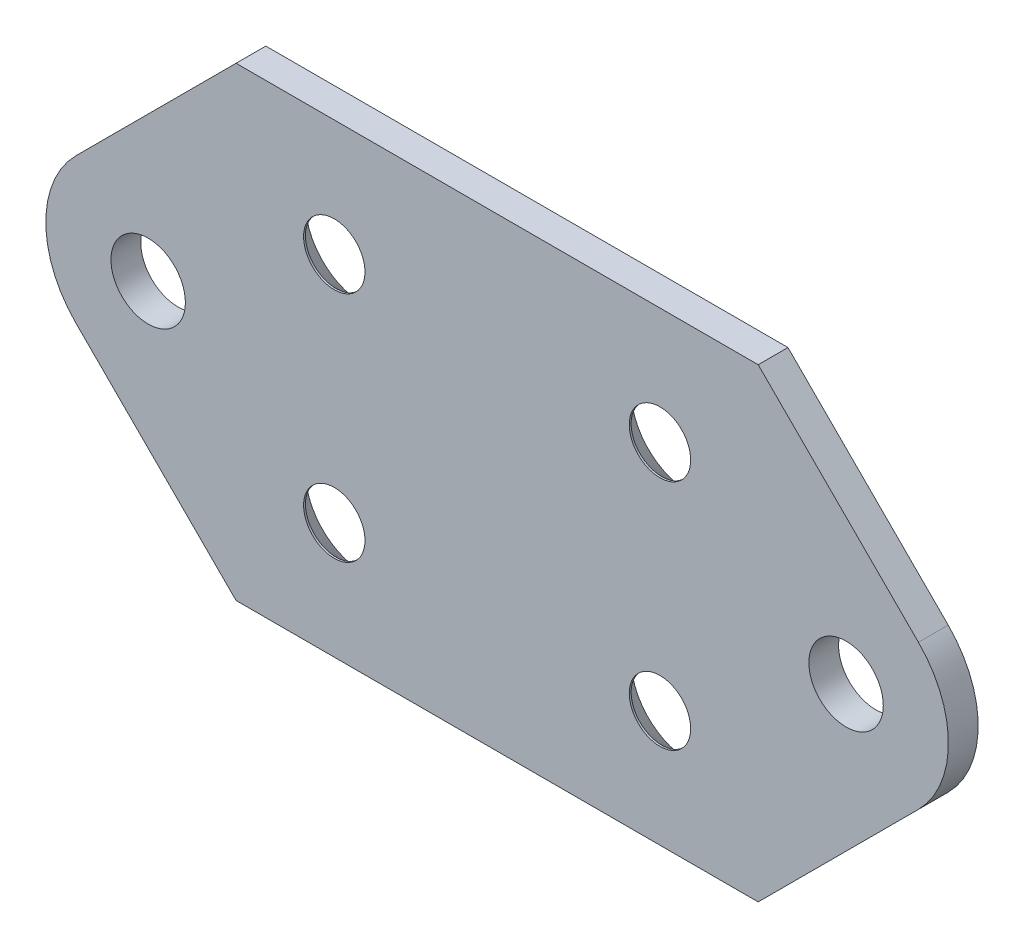
ISO-10303-21;
HEADER;
FILE_DESCRIPTION(('STEP AP214'),'2;1');
FILE_NAME('part.step','',(''),(''),'','','');
FILE_SCHEMA(('AUTOMOTIVE_DESIGN { 1 0 10303 214 1 1 1 1 }'));
ENDSEC;
DATA;
#1=APPLICATION_CONTEXT('core data for automotive mechanical design processes');
#2=APPLICATION_PROTOCOL_DEFINITION('international standard','automotive_design',2000,#1);
#3=PRODUCT_CONTEXT('',#1,'mechanical');
#4=PRODUCT('Part','Part','',(#3));
#5=PRODUCT_RELATED_PRODUCT_CATEGORY('part','',(#4));
#6=PRODUCT_DEFINITION_FORMATION('','',#4);
#7=PRODUCT_DEFINITION_CONTEXT('part definition',#1,'design');
#8=PRODUCT_DEFINITION('design','',#6,#7);
#9=PRODUCT_DEFINITION_SHAPE('','',#8);
#10=(LENGTH_UNIT() NAMED_UNIT(*) SI_UNIT(.MILLI.,.METRE.));
#11=(NAMED_UNIT(*) PLANE_ANGLE_UNIT() SI_UNIT($,.RADIAN.));
#12=(NAMED_UNIT(*) SI_UNIT($,.STERADIAN.) SOLID_ANGLE_UNIT());
#13=UNCERTAINTY_MEASURE_WITH_UNIT(LENGTH_MEASURE(1.E-05),#10,'distance_accuracy_value','');
#14=(GEOMETRIC_REPRESENTATION_CONTEXT(3) GLOBAL_UNCERTAINTY_ASSIGNED_CONTEXT((#13)) GLOBAL_UNIT_ASSIGNED_CONTEXT((#10,
#11,#12)) REPRESENTATION_CONTEXT('',''));
#15=CARTESIAN_POINT('',(0.,0.,0.));
#16=DIRECTION('',(0.,0.,1.));
#17=DIRECTION('',(1.,0.,0.));
#18=AXIS2_PLACEMENT_3D('',#15,#16,#17);
#19=CARTESIAN_POINT('',(0.,0.,0.));
#20=DIRECTION('',(0.,0.,0.999999999999988));
#21=DIRECTION('',(0.999999999999994,0.,0.));
#22=AXIS2_PLACEMENT_3D('',#19,#20,#21);
#23=PLANE('',#22);
#24=CARTESIAN_POINT('',(20.,12.4999999999997,0.));
#25=DIRECTION('',(0.,0.,-0.999999999999988));
#26=DIRECTION('',(-0.999999999999994,0.,0.));
#27=AXIS2_PLACEMENT_3D('',#24,#25,#26);
#28=CIRCLE('',#27,6.3);
#29=CARTESIAN_POINT('',(13.7,12.4999999999997,0.));
#30=VERTEX_POINT('',#29);
#31=EDGE_CURVE('E297',#30,#30,#28,.T.);
#32=ORIENTED_EDGE('',*,*,#31,.F.);
#33=EDGE_LOOP('',(#32));
#34=FACE_BOUND('',#33,.T.);
#35=CARTESIAN_POINT('',(54.9999999999995,-12.5000000000001,0.));
#36=DIRECTION('',(0.,0.,-0.999999999999988));
#37=DIRECTION('',(-0.999999999999994,0.,0.));
#38=AXIS2_PLACEMENT_3D('',#35,#36,#37);
#39=CIRCLE('',#38,6.3);
#40=CARTESIAN_POINT('',(48.6999999999996,-12.5000000000001,0.));
#41=VERTEX_POINT('',#40);
#42=EDGE_CURVE('E273',#41,#41,#39,.T.);
#43=ORIENTED_EDGE('',*,*,#42,.F.);
#44=EDGE_LOOP('',(#43));
#45=FACE_BOUND('',#44,.T.);
#46=CARTESIAN_POINT('',(19.9999999999998,-12.5000000000001,0.));
#47=DIRECTION('',(0.,0.,-0.999999999999988));
#48=DIRECTION('',(-0.999999999999994,0.,0.));
#49=AXIS2_PLACEMENT_3D('',#46,#47,#48);
#50=CIRCLE('',#49,6.3);
#51=CARTESIAN_POINT('',(13.6999999999999,-12.5000000000001,0.));
#52=VERTEX_POINT('',#51);
#53=EDGE_CURVE('E261',#52,#52,#50,.T.);
#54=ORIENTED_EDGE('',*,*,#53,.F.);
#55=EDGE_LOOP('',(#54));
#56=FACE_BOUND('',#55,.T.);
#57=DIRECTION('',(-0.707106781186535,-0.707106781186548,0.));
#58=VECTOR('',#57,1.);
#59=CARTESIAN_POINT('',(9.4436508138955,24.9999999999997,2.77555756156289E-13));
#60=LINE('',#59,#58);
#61=CARTESIAN_POINT('',(9.4436508138955,24.9999999999997,2.77555756156289E-13));
#62=VERTEX_POINT('',#61);
#63=CARTESIAN_POINT('',(-7.77817459305213,7.7781745930518,0.));
#64=VERTEX_POINT('',#63);
#65=EDGE_CURVE('E169',#62,#64,#60,.T.);
#66=ORIENTED_EDGE('',*,*,#65,.F.);
#67=DIRECTION('',(-0.999999999999994,0.,0.));
#68=VECTOR('',#67,1.);
#69=CARTESIAN_POINT('',(9.4436508138955,24.9999999999997,2.77555756156289E-13));
#70=LINE('',#69,#68);
#71=CARTESIAN_POINT('',(65.5563491861036,24.9999999999996,1.94289029309402E-13));
#72=VERTEX_POINT('',#71);
#73=EDGE_CURVE('E118',#72,#62,#70,.T.);
#74=ORIENTED_EDGE('',*,*,#73,.F.);
#75=DIRECTION('',(-0.707106781186535,0.707106781186548,0.));
#76=VECTOR('',#75,1.);
#77=CARTESIAN_POINT('',(65.5563491861036,24.9999999999996,1.94289029309402E-13));
#78=LINE('',#77,#76);
#79=CARTESIAN_POINT('',(82.7781745930513,7.77817459305163,-2.4980018054066E-13));
#80=VERTEX_POINT('',#79);
#81=EDGE_CURVE('E112',#80,#72,#78,.T.);
#82=ORIENTED_EDGE('',*,*,#81,.F.);
#83=CARTESIAN_POINT('',(74.9999999999992,-1.11022302462516E-13,0.));
#84=DIRECTION('',(0.,0.,0.999999999999988));
#85=DIRECTION('',(-0.999999999999994,0.,0.));
#86=AXIS2_PLACEMENT_3D('',#83,#84,#85);
#87=CIRCLE('',#86,11.);
#88=CARTESIAN_POINT('',(82.7781745930512,-7.77817459305201,-1.94289029309402E-13));
#89=VERTEX_POINT('',#88);
#90=EDGE_CURVE('E155',#89,#80,#87,.T.);
#91=ORIENTED_EDGE('',*,*,#90,.F.);
#92=DIRECTION('',(0.707106781186546,0.707106781186538,0.));
#93=VECTOR('',#92,1.);
#94=CARTESIAN_POINT('',(65.5563491861031,-24.9999999999998,2.77555756156289E-13));
#95=LINE('',#94,#93);
#96=CARTESIAN_POINT('',(65.5563491861031,-24.9999999999998,2.77555756156289E-13));
#97=VERTEX_POINT('',#96);
#98=EDGE_CURVE('E183',#97,#89,#95,.T.);
#99=ORIENTED_EDGE('',*,*,#98,.F.);
#100=DIRECTION('',(0.999999999999994,0.,0.));
#101=VECTOR('',#100,1.);
#102=CARTESIAN_POINT('',(9.44365081389605,-25.,3.33066907387547E-13));
#103=LINE('',#102,#101);
#104=CARTESIAN_POINT('',(9.44365081389605,-25.,3.33066907387547E-13));
#105=VERTEX_POINT('',#104);
#106=EDGE_CURVE('E180',#105,#97,#103,.T.);
#107=ORIENTED_EDGE('',*,*,#106,.F.);
#108=DIRECTION('',(0.707106781186546,-0.707106781186538,0.));
#109=VECTOR('',#108,1.);
#110=CARTESIAN_POINT('',(9.44365081389605,-25.,3.33066907387547E-13));
#111=LINE('',#110,#109);
#112=CARTESIAN_POINT('',(-7.77817459305175,-7.77817459305206,1.11022302462516E-13));
#113=VERTEX_POINT('',#112);
#114=EDGE_CURVE('E177',#113,#105,#111,.T.);
#115=ORIENTED_EDGE('',*,*,#114,.F.);
#116=CARTESIAN_POINT('',(0.,0.,0.));
#117=DIRECTION('',(0.,0.,0.999999999999988));
#118=DIRECTION('',(0.999999999999994,0.,0.));
#119=AXIS2_PLACEMENT_3D('',#116,#117,#118);
#120=CIRCLE('',#119,11.);
#121=EDGE_CURVE('E173',#64,#113,#120,.T.);
#122=ORIENTED_EDGE('',*,*,#121,.F.);
#123=EDGE_LOOP('',(#66,#74,#82,#91,#99,#107,#115,#122));
#124=FACE_BOUND('',#123,.T.);
#125=CARTESIAN_POINT('',(0.,0.,0.));
#126=DIRECTION('',(0.,0.,0.999999999999988));
#127=DIRECTION('',(0.999999999999994,0.,0.));
#128=AXIS2_PLACEMENT_3D('',#125,#126,#127);
#129=CIRCLE('',#128,4.);
#130=CARTESIAN_POINT('',(3.99999999999997,0.,0.));
#131=VERTEX_POINT('',#130);
#132=EDGE_CURVE('E238',#131,#131,#129,.T.);
#133=ORIENTED_EDGE('',*,*,#132,.T.);
#134=EDGE_LOOP('',(#133));
#135=FACE_BOUND('',#134,.T.);
#136=CARTESIAN_POINT('',(74.9999999999992,-1.11022302462516E-13,0.));
#137=DIRECTION('',(0.,0.,0.999999999999988));
#138=DIRECTION('',(0.999999999999994,0.,0.));
#139=AXIS2_PLACEMENT_3D('',#136,#137,#138);
#140=CIRCLE('',#139,4.00000000000001);
#141=CARTESIAN_POINT('',(78.9999999999992,-1.1102924135642E-13,0.));
#142=VERTEX_POINT('',#141);
#143=EDGE_CURVE('E246',#142,#142,#140,.T.);
#144=ORIENTED_EDGE('',*,*,#143,.T.);
#145=EDGE_LOOP('',(#144));
#146=FACE_BOUND('',#145,.T.);
#147=CARTESIAN_POINT('',(54.9999999999995,12.4999999999997,-1.11022302462516E-13));
#148=DIRECTION('',(0.,0.,-0.999999999999988));
#149=DIRECTION('',(-0.999999999999994,0.,0.));
#150=AXIS2_PLACEMENT_3D('',#147,#148,#149);
#151=CIRCLE('',#150,6.3);
#152=CARTESIAN_POINT('',(48.6999999999995,12.4999999999997,-1.11022302462516E-13));
#153=VERTEX_POINT('',#152);
#154=EDGE_CURVE('E285',#153,#153,#151,.T.);
#155=ORIENTED_EDGE('',*,*,#154,.F.);
#156=EDGE_LOOP('',(#155));
#157=FACE_BOUND('',#156,.T.);
#158=ADVANCED_FACE('F65',(#34,#45,#56,#124,#135,#146,#157),#23,.F.);
#159=CARTESIAN_POINT('',(1.52655665885959E-13,-1.66533453693773E-13,3.19999999999998));
#160=DIRECTION('',(0.,0.,0.999999999999988));
#161=DIRECTION('',(0.999999999999994,0.,0.));
#162=AXIS2_PLACEMENT_3D('',#159,#160,#161);
#163=PLANE('',#162);
#164=CARTESIAN_POINT('',(19.9999999999999,12.4999999999996,3.19999999999993));
#165=DIRECTION('',(0.,0.,-0.999999999999988));
#166=DIRECTION('',(-0.999999999999994,0.,0.));
#167=AXIS2_PLACEMENT_3D('',#164,#165,#166);
#168=CIRCLE('',#167,3.3);
#169=CARTESIAN_POINT('',(16.6999999999999,12.4999999999996,3.19999999999993));
#170=VERTEX_POINT('',#169);
#171=EDGE_CURVE('E289',#170,#170,#168,.T.);
#172=ORIENTED_EDGE('',*,*,#171,.T.);
#173=EDGE_LOOP('',(#172));
#174=FACE_BOUND('',#173,.T.);
#175=CARTESIAN_POINT('',(54.9999999999995,12.4999999999996,3.19999999999987));
#176=DIRECTION('',(0.,0.,-0.999999999999988));
#177=DIRECTION('',(-0.999999999999994,0.,0.));
#178=AXIS2_PLACEMENT_3D('',#175,#176,#177);
#179=CIRCLE('',#178,3.3);
#180=CARTESIAN_POINT('',(51.6999999999995,12.4999999999996,3.19999999999987));
#181=VERTEX_POINT('',#180);
#182=EDGE_CURVE('E277',#181,#181,#179,.T.);
#183=ORIENTED_EDGE('',*,*,#182,.T.);
#184=EDGE_LOOP('',(#183));
#185=FACE_BOUND('',#184,.T.);
#186=CARTESIAN_POINT('',(54.9999999999995,-12.5000000000001,3.19999999999993));
#187=DIRECTION('',(0.,0.,-0.999999999999988));
#188=DIRECTION('',(-0.999999999999994,0.,0.));
#189=AXIS2_PLACEMENT_3D('',#186,#187,#188);
#190=CIRCLE('',#189,3.3);
#191=CARTESIAN_POINT('',(51.6999999999995,-12.5000000000001,3.19999999999993));
#192=VERTEX_POINT('',#191);
#193=EDGE_CURVE('E265',#192,#192,#190,.T.);
#194=ORIENTED_EDGE('',*,*,#193,.T.);
#195=EDGE_LOOP('',(#194));
#196=FACE_BOUND('',#195,.T.);
#197=CARTESIAN_POINT('',(19.9999999999999,-12.5000000000001,3.19999999999995));
#198=DIRECTION('',(0.,0.,-0.999999999999988));
#199=DIRECTION('',(-0.999999999999994,0.,0.));
#200=AXIS2_PLACEMENT_3D('',#197,#198,#199);
#201=CIRCLE('',#200,3.3);
#202=CARTESIAN_POINT('',(16.6999999999999,-12.5000000000001,3.19999999999995));
#203=VERTEX_POINT('',#202);
#204=EDGE_CURVE('E250',#203,#203,#201,.T.);
#205=ORIENTED_EDGE('',*,*,#204,.T.);
#206=EDGE_LOOP('',(#205));
#207=FACE_BOUND('',#206,.T.);
#208=CARTESIAN_POINT('',(1.52655665885959E-13,-1.66533453693773E-13,3.19999999999998));
#209=DIRECTION('',(0.,0.,0.999999999999988));
#210=DIRECTION('',(0.999999999999994,0.,0.));
#211=AXIS2_PLACEMENT_3D('',#208,#209,#210);
#212=CIRCLE('',#211,4.);
#213=CARTESIAN_POINT('',(4.00000000000013,-1.66540392587677E-13,3.19999999999998));
#214=VERTEX_POINT('',#213);
#215=EDGE_CURVE('E174',#214,#214,#212,.T.);
#216=ORIENTED_EDGE('',*,*,#215,.F.);
#217=EDGE_LOOP('',(#216));
#218=FACE_BOUND('',#217,.T.);
#219=DIRECTION('',(-0.707106781186535,-0.707106781186548,0.));
#220=VECTOR('',#219,1.);
#221=CARTESIAN_POINT('',(9.4436508138955,24.9999999999995,3.2000000000002));
#222=LINE('',#221,#220);
#223=CARTESIAN_POINT('',(9.4436508138955,24.9999999999995,3.2000000000002));
#224=VERTEX_POINT('',#223);
#225=CARTESIAN_POINT('',(-7.77817459305213,7.77817459305169,3.20000000000001));
#226=VERTEX_POINT('',#225);
#227=EDGE_CURVE('E192',#224,#226,#222,.T.);
#228=ORIENTED_EDGE('',*,*,#227,.T.);
#229=CARTESIAN_POINT('',(1.52655665885959E-13,-1.66533453693773E-13,3.19999999999998));
#230=DIRECTION('',(0.,0.,0.999999999999988));
#231=DIRECTION('',(0.999999999999994,0.,0.));
#232=AXIS2_PLACEMENT_3D('',#229,#230,#231);
#233=CIRCLE('',#232,11.);
#234=CARTESIAN_POINT('',(-7.7781745930517,-7.77817459305221,3.20000000000004));
#235=VERTEX_POINT('',#234);
#236=EDGE_CURVE('E126',#226,#235,#233,.T.);
#237=ORIENTED_EDGE('',*,*,#236,.T.);
#238=DIRECTION('',(0.707106781186546,-0.707106781186538,0.));
#239=VECTOR('',#238,1.);
#240=CARTESIAN_POINT('',(9.44365081389614,-25.,3.20000000000018));
#241=LINE('',#240,#239);
#242=CARTESIAN_POINT('',(9.44365081389614,-25.,3.20000000000018));
#243=VERTEX_POINT('',#242);
#244=EDGE_CURVE('E214',#235,#243,#241,.T.);
#245=ORIENTED_EDGE('',*,*,#244,.T.);
#246=DIRECTION('',(0.999999999999994,0.,0.));
#247=VECTOR('',#246,1.);
#248=CARTESIAN_POINT('',(9.44365081389614,-25.,3.20000000000018));
#249=LINE('',#248,#247);
#250=CARTESIAN_POINT('',(65.5563491861031,-25.,3.20000000000026));
#251=VERTEX_POINT('',#250);
#252=EDGE_CURVE('E227',#243,#251,#249,.T.);
#253=ORIENTED_EDGE('',*,*,#252,.T.);
#254=DIRECTION('',(0.707106781186546,0.707106781186538,0.));
#255=VECTOR('',#254,1.);
#256=CARTESIAN_POINT('',(65.5563491861031,-25.,3.20000000000026));
#257=LINE('',#256,#255);
#258=CARTESIAN_POINT('',(82.7781745930513,-7.77817459305201,3.19999999999984));
#259=VERTEX_POINT('',#258);
#260=EDGE_CURVE('E146',#251,#259,#257,.T.);
#261=ORIENTED_EDGE('',*,*,#260,.T.);
#262=CARTESIAN_POINT('',(74.9999999999992,-2.22044604925031E-13,3.1999999999999));
#263=DIRECTION('',(0.,0.,0.999999999999988));
#264=DIRECTION('',(-0.999999999999994,0.,0.));
#265=AXIS2_PLACEMENT_3D('',#262,#263,#264);
#266=CIRCLE('',#265,11.);
#267=CARTESIAN_POINT('',(82.7781745930514,7.77817459305168,3.19999999999979));
#268=VERTEX_POINT('',#267);
#269=EDGE_CURVE('E139',#259,#268,#266,.T.);
#270=ORIENTED_EDGE('',*,*,#269,.T.);
#271=DIRECTION('',(-0.707106781186535,0.707106781186548,0.));
#272=VECTOR('',#271,1.);
#273=CARTESIAN_POINT('',(65.5563491861037,24.9999999999996,3.20000000000012));
#274=LINE('',#273,#272);
#275=CARTESIAN_POINT('',(65.5563491861037,24.9999999999996,3.20000000000012));
#276=VERTEX_POINT('',#275);
#277=EDGE_CURVE('E144',#268,#276,#274,.T.);
#278=ORIENTED_EDGE('',*,*,#277,.T.);
#279=DIRECTION('',(-0.999999999999994,0.,0.));
#280=VECTOR('',#279,1.);
#281=CARTESIAN_POINT('',(9.4436508138955,24.9999999999995,3.2000000000002));
#282=LINE('',#281,#280);
#283=EDGE_CURVE('E83',#276,#224,#282,.T.);
#284=ORIENTED_EDGE('',*,*,#283,.T.);
#285=EDGE_LOOP('',(#228,#237,#245,#253,#261,#270,#278,#284));
#286=FACE_BOUND('',#285,.T.);
#287=CARTESIAN_POINT('',(74.9999999999992,-2.22044604925031E-13,3.1999999999999));
#288=DIRECTION('',(0.,0.,0.999999999999988));
#289=DIRECTION('',(0.999999999999994,0.,0.));
#290=AXIS2_PLACEMENT_3D('',#287,#288,#289);
#291=CIRCLE('',#290,4.00000000000001);
#292=CARTESIAN_POINT('',(78.9999999999992,-2.22051543818935E-13,3.1999999999999));
#293=VERTEX_POINT('',#292);
#294=EDGE_CURVE('E242',#293,#293,#291,.T.);
#295=ORIENTED_EDGE('',*,*,#294,.F.);
#296=EDGE_LOOP('',(#295));
#297=FACE_BOUND('',#296,.T.);
#298=ADVANCED_FACE('F141',(#174,#185,#196,#207,#218,#286,#297),#163,.T.);
#299=CARTESIAN_POINT('',(9.4436508138955,24.9999999999995,3.2000000000002));
#300=DIRECTION('',(0.707106781186548,-0.707106781186535,0.));
#301=DIRECTION('',(0.707106781186535,0.707106781186549,0.));
#302=AXIS2_PLACEMENT_3D('',#299,#300,#301);
#303=PLANE('',#302);
#304=ORIENTED_EDGE('',*,*,#65,.T.);
#305=DIRECTION('',(0.,0.,-0.999999999999988));
#306=VECTOR('',#305,1.);
#307=CARTESIAN_POINT('',(-7.77817459305213,7.77817459305169,3.20000000000001));
#308=LINE('',#307,#306);
#309=EDGE_CURVE('E13',#226,#64,#308,.T.);
#310=ORIENTED_EDGE('',*,*,#309,.F.);
#311=ORIENTED_EDGE('',*,*,#227,.F.);
#312=DIRECTION('',(0.,0.,-0.999999999999988));
#313=VECTOR('',#312,1.);
#314=CARTESIAN_POINT('',(9.4436508138955,24.9999999999995,3.2000000000002));
#315=LINE('',#314,#313);
#316=EDGE_CURVE('E165',#224,#62,#315,.T.);
#317=ORIENTED_EDGE('',*,*,#316,.T.);
#318=EDGE_LOOP('',(#304,#310,#311,#317));
#319=FACE_BOUND('',#318,.T.);
#320=ADVANCED_FACE('F67',(#319),#303,.F.);
#321=CARTESIAN_POINT('',(1.52655665885959E-13,-1.66533453693773E-13,3.19999999999998));
#322=DIRECTION('',(0.,0.,-0.999999999999988));
#323=DIRECTION('',(-0.999999999999994,0.,0.));
#324=AXIS2_PLACEMENT_3D('',#321,#322,#323);
#325=CYLINDRICAL_SURFACE('',#324,11.);
#326=ORIENTED_EDGE('',*,*,#121,.T.);
#327=DIRECTION('',(0.,0.,-0.999999999999988));
#328=VECTOR('',#327,1.);
#329=CARTESIAN_POINT('',(-7.7781745930517,-7.77817459305221,3.20000000000004));
#330=LINE('',#329,#328);
#331=EDGE_CURVE('E75',#235,#113,#330,.T.);
#332=ORIENTED_EDGE('',*,*,#331,.F.);
#333=ORIENTED_EDGE('',*,*,#236,.F.);
#334=ORIENTED_EDGE('',*,*,#309,.T.);
#335=EDGE_LOOP('',(#326,#332,#333,#334));
#336=FACE_BOUND('',#335,.T.);
#337=ADVANCED_FACE('F353',(#336),#325,.T.);
#338=CARTESIAN_POINT('',(9.44365081389614,-25.,3.20000000000018));
#339=DIRECTION('',(0.707106781186538,0.707106781186546,0.));
#340=DIRECTION('',(-0.707106781186546,0.707106781186538,0.));
#341=AXIS2_PLACEMENT_3D('',#338,#339,#340);
#342=PLANE('',#341);
#343=ORIENTED_EDGE('',*,*,#114,.T.);
#344=DIRECTION('',(0.,0.,-0.999999999999988));
#345=VECTOR('',#344,1.);
#346=CARTESIAN_POINT('',(9.44365081389614,-25.,3.20000000000018));
#347=LINE('',#346,#345);
#348=EDGE_CURVE('E203',#243,#105,#347,.T.);
#349=ORIENTED_EDGE('',*,*,#348,.F.);
#350=ORIENTED_EDGE('',*,*,#244,.F.);
#351=ORIENTED_EDGE('',*,*,#331,.T.);
#352=EDGE_LOOP('',(#343,#349,#350,#351));
#353=FACE_BOUND('',#352,.T.);
#354=ADVANCED_FACE('F212',(#353),#342,.F.);
#355=CARTESIAN_POINT('',(9.44365081389614,-25.,3.20000000000018));
#356=DIRECTION('',(0.,0.999999999999994,0.));
#357=DIRECTION('',(0.,0.,0.999999999999988));
#358=AXIS2_PLACEMENT_3D('',#355,#356,#357);
#359=PLANE('',#358);
#360=ORIENTED_EDGE('',*,*,#106,.T.);
#361=DIRECTION('',(0.,0.,-0.999999999999988));
#362=VECTOR('',#361,1.);
#363=CARTESIAN_POINT('',(65.5563491861031,-25.,3.20000000000026));
#364=LINE('',#363,#362);
#365=EDGE_CURVE('E199',#251,#97,#364,.T.);
#366=ORIENTED_EDGE('',*,*,#365,.F.);
#367=ORIENTED_EDGE('',*,*,#252,.F.);
#368=ORIENTED_EDGE('',*,*,#348,.T.);
#369=EDGE_LOOP('',(#360,#366,#367,#368));
#370=FACE_BOUND('',#369,.T.);
#371=ADVANCED_FACE('F222',(#370),#359,.F.);
#372=CARTESIAN_POINT('',(65.5563491861031,-25.,3.20000000000026));
#373=DIRECTION('',(-0.707106781186538,0.707106781186546,0.));
#374=DIRECTION('',(-0.707106781186546,-0.707106781186538,0.));
#375=AXIS2_PLACEMENT_3D('',#372,#373,#374);
#376=PLANE('',#375);
#377=ORIENTED_EDGE('',*,*,#98,.T.);
#378=DIRECTION('',(0.,0.,-0.999999999999988));
#379=VECTOR('',#378,1.);
#380=CARTESIAN_POINT('',(82.7781745930513,-7.77817459305201,3.19999999999984));
#381=LINE('',#380,#379);
#382=EDGE_CURVE('E157',#259,#89,#381,.T.);
#383=ORIENTED_EDGE('',*,*,#382,.F.);
#384=ORIENTED_EDGE('',*,*,#260,.F.);
#385=ORIENTED_EDGE('',*,*,#365,.T.);
#386=EDGE_LOOP('',(#377,#383,#384,#385));
#387=FACE_BOUND('',#386,.T.);
#388=ADVANCED_FACE('F225',(#387),#376,.F.);
#389=CARTESIAN_POINT('',(74.9999999999992,-2.22044604925031E-13,3.1999999999999));
#390=DIRECTION('',(0.,0.,-0.999999999999988));
#391=DIRECTION('',(-0.999999999999994,0.,0.));
#392=AXIS2_PLACEMENT_3D('',#389,#390,#391);
#393=CYLINDRICAL_SURFACE('',#392,11.);
#394=ORIENTED_EDGE('',*,*,#90,.T.);
#395=DIRECTION('',(0.,0.,-0.999999999999988));
#396=VECTOR('',#395,1.);
#397=CARTESIAN_POINT('',(82.7781745930514,7.77817459305168,3.19999999999979));
#398=LINE('',#397,#396);
#399=EDGE_CURVE('E152',#268,#80,#398,.T.);
#400=ORIENTED_EDGE('',*,*,#399,.F.);
#401=ORIENTED_EDGE('',*,*,#269,.F.);
#402=ORIENTED_EDGE('',*,*,#382,.T.);
#403=EDGE_LOOP('',(#394,#400,#401,#402));
#404=FACE_BOUND('',#403,.T.);
#405=ADVANCED_FACE('F153',(#404),#393,.T.);
#406=CARTESIAN_POINT('',(65.5563491861037,24.9999999999996,3.20000000000012));
#407=DIRECTION('',(-0.707106781186548,-0.707106781186535,0.));
#408=DIRECTION('',(0.707106781186535,-0.707106781186548,0.));
#409=AXIS2_PLACEMENT_3D('',#406,#407,#408);
#410=PLANE('',#409);
#411=ORIENTED_EDGE('',*,*,#81,.T.);
#412=DIRECTION('',(0.,0.,-0.999999999999988));
#413=VECTOR('',#412,1.);
#414=CARTESIAN_POINT('',(65.5563491861037,24.9999999999996,3.20000000000012));
#415=LINE('',#414,#413);
#416=EDGE_CURVE('E158',#276,#72,#415,.T.);
#417=ORIENTED_EDGE('',*,*,#416,.F.);
#418=ORIENTED_EDGE('',*,*,#277,.F.);
#419=ORIENTED_EDGE('',*,*,#399,.T.);
#420=EDGE_LOOP('',(#411,#417,#418,#419));
#421=FACE_BOUND('',#420,.T.);
#422=ADVANCED_FACE('F160',(#421),#410,.F.);
#423=CARTESIAN_POINT('',(9.4436508138955,24.9999999999995,3.2000000000002));
#424=DIRECTION('',(0.,-0.999999999999994,0.));
#425=DIRECTION('',(0.,0.,-0.999999999999988));
#426=AXIS2_PLACEMENT_3D('',#423,#424,#425);
#427=PLANE('',#426);
#428=ORIENTED_EDGE('',*,*,#73,.T.);
#429=ORIENTED_EDGE('',*,*,#316,.F.);
#430=ORIENTED_EDGE('',*,*,#283,.F.);
#431=ORIENTED_EDGE('',*,*,#416,.T.);
#432=EDGE_LOOP('',(#428,#429,#430,#431));
#433=FACE_BOUND('',#432,.T.);
#434=ADVANCED_FACE('F337',(#433),#427,.F.);
#435=CARTESIAN_POINT('',(1.52655665885959E-13,-1.66533453693773E-13,3.19999999999998));
#436=DIRECTION('',(0.,0.,-0.999999999999988));
#437=DIRECTION('',(-0.999999999999994,0.,0.));
#438=AXIS2_PLACEMENT_3D('',#435,#436,#437);
#439=CYLINDRICAL_SURFACE('',#438,4.);
#440=ORIENTED_EDGE('',*,*,#215,.T.);
#441=EDGE_LOOP('',(#440));
#442=FACE_BOUND('',#441,.T.);
#443=ORIENTED_EDGE('',*,*,#132,.F.);
#444=EDGE_LOOP('',(#443));
#445=FACE_BOUND('',#444,.T.);
#446=ADVANCED_FACE('F333',(#442,#445),#439,.F.);
#447=CARTESIAN_POINT('',(74.9999999999992,-2.22044604925031E-13,3.1999999999999));
#448=DIRECTION('',(0.,0.,-0.999999999999988));
#449=DIRECTION('',(-0.999999999999994,0.,0.));
#450=AXIS2_PLACEMENT_3D('',#447,#448,#449);
#451=CYLINDRICAL_SURFACE('',#450,4.00000000000001);
#452=ORIENTED_EDGE('',*,*,#294,.T.);
#453=EDGE_LOOP('',(#452));
#454=FACE_BOUND('',#453,.T.);
#455=ORIENTED_EDGE('',*,*,#143,.F.);
#456=EDGE_LOOP('',(#455));
#457=FACE_BOUND('',#456,.T.);
#458=ADVANCED_FACE('F325',(#454,#457),#451,.F.);
#459=CARTESIAN_POINT('',(19.9999999999998,-12.5000000000001,0.));
#460=DIRECTION('',(0.,0.,-0.999999999999988));
#461=DIRECTION('',(-0.999999999999994,0.,0.));
#462=AXIS2_PLACEMENT_3D('',#459,#460,#461);
#463=CYLINDRICAL_SURFACE('',#462,3.3);
#464=ORIENTED_EDGE('',*,*,#204,.F.);
#465=EDGE_LOOP('',(#464));
#466=FACE_BOUND('',#465,.T.);
#467=CARTESIAN_POINT('',(19.9999999999999,-12.5000000000001,2.99999999999998));
#468=DIRECTION('',(0.,0.,-0.999999999999988));
#469=DIRECTION('',(-0.999999999999994,0.,0.));
#470=AXIS2_PLACEMENT_3D('',#467,#468,#469);
#471=CIRCLE('',#470,3.3);
#472=CARTESIAN_POINT('',(16.6999999999999,-12.5000000000001,2.99999999999998));
#473=VERTEX_POINT('',#472);
#474=EDGE_CURVE('E257',#473,#473,#471,.T.);
#475=ORIENTED_EDGE('',*,*,#474,.T.);
#476=EDGE_LOOP('',(#475));
#477=FACE_BOUND('',#476,.T.);
#478=ADVANCED_FACE('F315',(#466,#477),#463,.F.);
#479=CARTESIAN_POINT('',(19.9999999999998,-12.5000000000001,0.));
#480=DIRECTION('',(0.,0.,-0.999999999999988));
#481=DIRECTION('',(-0.999999999999994,0.,0.));
#482=AXIS2_PLACEMENT_3D('',#479,#480,#481);
#483=CONICAL_SURFACE('',#482,6.3,0.785398163397448);
#484=ORIENTED_EDGE('',*,*,#474,.F.);
#485=EDGE_LOOP('',(#484));
#486=FACE_BOUND('',#485,.T.);
#487=ORIENTED_EDGE('',*,*,#53,.T.);
#488=EDGE_LOOP('',(#487));
#489=FACE_BOUND('',#488,.T.);
#490=ADVANCED_FACE('F312',(#486,#489),#483,.F.);
#491=CARTESIAN_POINT('',(54.9999999999995,-12.5000000000001,0.));
#492=DIRECTION('',(0.,0.,-0.999999999999988));
#493=DIRECTION('',(-0.999999999999994,0.,0.));
#494=AXIS2_PLACEMENT_3D('',#491,#492,#493);
#495=CYLINDRICAL_SURFACE('',#494,3.3);
#496=ORIENTED_EDGE('',*,*,#193,.F.);
#497=EDGE_LOOP('',(#496));
#498=FACE_BOUND('',#497,.T.);
#499=CARTESIAN_POINT('',(54.9999999999996,-12.5000000000003,2.99999999999995));
#500=DIRECTION('',(0.,0.,-0.999999999999988));
#501=DIRECTION('',(-0.999999999999994,0.,0.));
#502=AXIS2_PLACEMENT_3D('',#499,#500,#501);
#503=CIRCLE('',#502,3.3);
#504=CARTESIAN_POINT('',(51.6999999999996,-12.5000000000003,2.99999999999995));
#505=VERTEX_POINT('',#504);
#506=EDGE_CURVE('E269',#505,#505,#503,.T.);
#507=ORIENTED_EDGE('',*,*,#506,.T.);
#508=EDGE_LOOP('',(#507));
#509=FACE_BOUND('',#508,.T.);
#510=ADVANCED_FACE('F314',(#498,#509),#495,.F.);
#511=CARTESIAN_POINT('',(54.9999999999995,-12.5000000000001,0.));
#512=DIRECTION('',(0.,0.,-0.999999999999988));
#513=DIRECTION('',(-0.999999999999994,0.,0.));
#514=AXIS2_PLACEMENT_3D('',#511,#512,#513);
#515=CONICAL_SURFACE('',#514,6.3,0.785398163397449);
#516=ORIENTED_EDGE('',*,*,#506,.F.);
#517=EDGE_LOOP('',(#516));
#518=FACE_BOUND('',#517,.T.);
#519=ORIENTED_EDGE('',*,*,#42,.T.);
#520=EDGE_LOOP('',(#519));
#521=FACE_BOUND('',#520,.T.);
#522=ADVANCED_FACE('F322',(#518,#521),#515,.F.);
#523=CARTESIAN_POINT('',(54.9999999999995,12.4999999999997,-1.11022302462516E-13));
#524=DIRECTION('',(0.,0.,-0.999999999999988));
#525=DIRECTION('',(-0.999999999999994,0.,0.));
#526=AXIS2_PLACEMENT_3D('',#523,#524,#525);
#527=CYLINDRICAL_SURFACE('',#526,3.3);
#528=ORIENTED_EDGE('',*,*,#182,.F.);
#529=EDGE_LOOP('',(#528));
#530=FACE_BOUND('',#529,.T.);
#531=CARTESIAN_POINT('',(54.9999999999994,12.4999999999997,2.99999999999989));
#532=DIRECTION('',(0.,0.,-0.999999999999988));
#533=DIRECTION('',(-0.999999999999994,0.,0.));
#534=AXIS2_PLACEMENT_3D('',#531,#532,#533);
#535=CIRCLE('',#534,3.3);
#536=CARTESIAN_POINT('',(51.6999999999994,12.4999999999997,2.99999999999989));
#537=VERTEX_POINT('',#536);
#538=EDGE_CURVE('E281',#537,#537,#535,.T.);
#539=ORIENTED_EDGE('',*,*,#538,.T.);
#540=EDGE_LOOP('',(#539));
#541=FACE_BOUND('',#540,.T.);
#542=ADVANCED_FACE('F447',(#530,#541),#527,.F.);
#543=CARTESIAN_POINT('',(54.9999999999995,12.4999999999997,-1.11022302462516E-13));
#544=DIRECTION('',(0.,0.,-0.999999999999988));
#545=DIRECTION('',(-0.999999999999994,0.,0.));
#546=AXIS2_PLACEMENT_3D('',#543,#544,#545);
#547=CONICAL_SURFACE('',#546,6.3,0.785398163397449);
#548=ORIENTED_EDGE('',*,*,#538,.F.);
#549=EDGE_LOOP('',(#548));
#550=FACE_BOUND('',#549,.T.);
#551=ORIENTED_EDGE('',*,*,#154,.T.);
#552=EDGE_LOOP('',(#551));
#553=FACE_BOUND('',#552,.T.);
#554=ADVANCED_FACE('F454',(#550,#553),#547,.F.);
#555=CARTESIAN_POINT('',(20.,12.4999999999997,0.));
#556=DIRECTION('',(0.,0.,-0.999999999999988));
#557=DIRECTION('',(-0.999999999999994,0.,0.));
#558=AXIS2_PLACEMENT_3D('',#555,#556,#557);
#559=CYLINDRICAL_SURFACE('',#558,3.3);
#560=ORIENTED_EDGE('',*,*,#171,.F.);
#561=EDGE_LOOP('',(#560));
#562=FACE_BOUND('',#561,.T.);
#563=CARTESIAN_POINT('',(19.9999999999999,12.4999999999996,2.99999999999995));
#564=DIRECTION('',(0.,0.,-0.999999999999988));
#565=DIRECTION('',(-0.999999999999994,0.,0.));
#566=AXIS2_PLACEMENT_3D('',#563,#564,#565);
#567=CIRCLE('',#566,3.3);
#568=CARTESIAN_POINT('',(16.6999999999999,12.4999999999996,2.99999999999995));
#569=VERTEX_POINT('',#568);
#570=EDGE_CURVE('E293',#569,#569,#567,.T.);
#571=ORIENTED_EDGE('',*,*,#570,.T.);
#572=EDGE_LOOP('',(#571));
#573=FACE_BOUND('',#572,.T.);
#574=ADVANCED_FACE('F462',(#562,#573),#559,.F.);
#575=CARTESIAN_POINT('',(20.,12.4999999999997,0.));
#576=DIRECTION('',(0.,0.,-0.999999999999988));
#577=DIRECTION('',(-0.999999999999994,0.,0.));
#578=AXIS2_PLACEMENT_3D('',#575,#576,#577);
#579=CONICAL_SURFACE('',#578,6.3,0.785398163397448);
#580=ORIENTED_EDGE('',*,*,#570,.F.);
#581=EDGE_LOOP('',(#580));
#582=FACE_BOUND('',#581,.T.);
#583=ORIENTED_EDGE('',*,*,#31,.T.);
#584=EDGE_LOOP('',(#583));
#585=FACE_BOUND('',#584,.T.);
#586=ADVANCED_FACE('F303',(#582,#585),#579,.F.);
#587=CLOSED_SHELL('',(#158,#298,#320,#337,#354,#371,#388,#405,#422,#434,#446,#458,#478,#490,
#510,#522,#542,#554,#574,#586));
#588=MANIFOLD_SOLID_BREP('B2',#587);
#589=ADVANCED_BREP_SHAPE_REPRESENTATION('',(#18,#588),#14);
#590=SHAPE_DEFINITION_REPRESENTATION(#9,#589);
ENDSEC;
END-ISO-10303-21;
